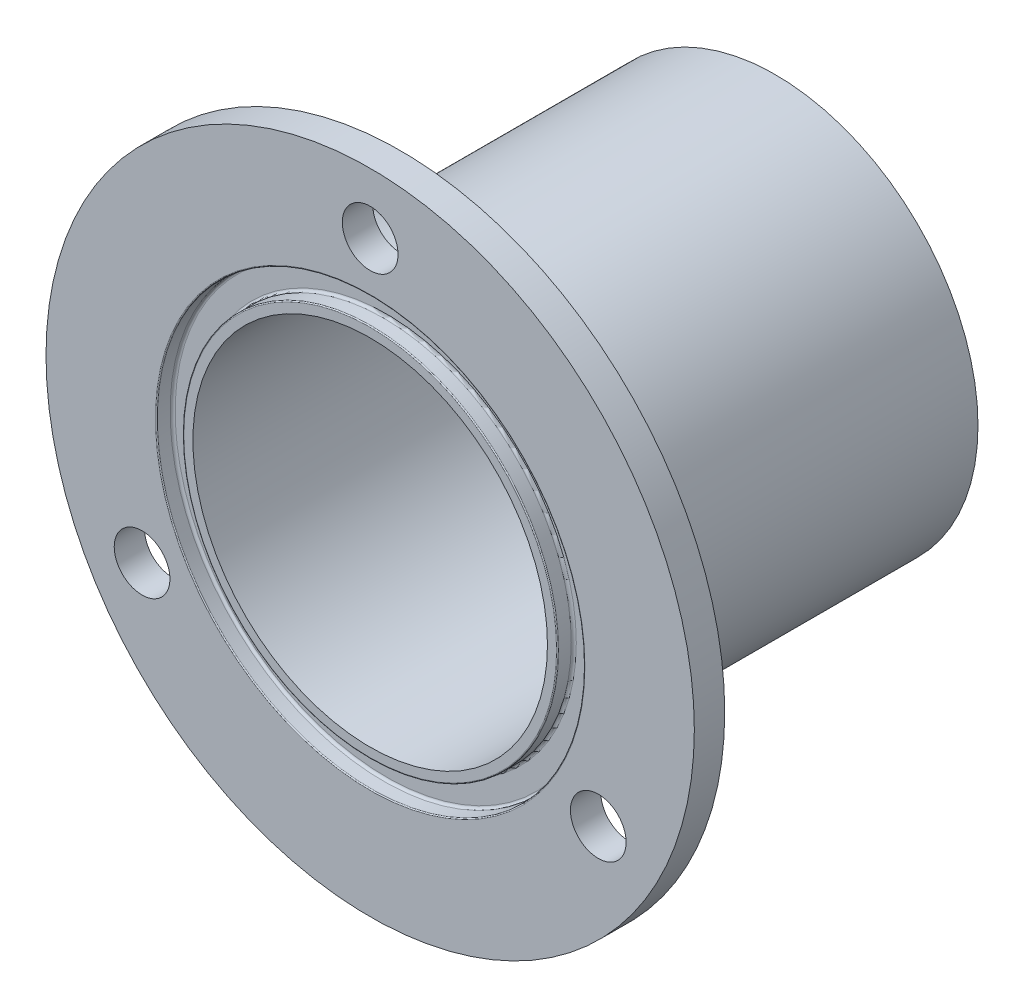
ISO-10303-21;
HEADER;
FILE_DESCRIPTION(('STEP AP214'),'2;1');
FILE_NAME('part.step','',(''),(''),'','','');
FILE_SCHEMA(('AUTOMOTIVE_DESIGN { 1 0 10303 214 1 1 1 1 }'));
ENDSEC;
DATA;
#1=APPLICATION_CONTEXT('core data for automotive mechanical design processes');
#2=APPLICATION_PROTOCOL_DEFINITION('international standard','automotive_design',2000,#1);
#3=PRODUCT_CONTEXT('',#1,'mechanical');
#4=PRODUCT('Part','Part','',(#3));
#5=PRODUCT_RELATED_PRODUCT_CATEGORY('part','',(#4));
#6=PRODUCT_DEFINITION_FORMATION('','',#4);
#7=PRODUCT_DEFINITION_CONTEXT('part definition',#1,'design');
#8=PRODUCT_DEFINITION('design','',#6,#7);
#9=PRODUCT_DEFINITION_SHAPE('','',#8);
#10=(LENGTH_UNIT() NAMED_UNIT(*) SI_UNIT(.MILLI.,.METRE.));
#11=(NAMED_UNIT(*) PLANE_ANGLE_UNIT() SI_UNIT($,.RADIAN.));
#12=(NAMED_UNIT(*) SI_UNIT($,.STERADIAN.) SOLID_ANGLE_UNIT());
#13=UNCERTAINTY_MEASURE_WITH_UNIT(LENGTH_MEASURE(1.E-05),#10,'distance_accuracy_value','');
#14=(GEOMETRIC_REPRESENTATION_CONTEXT(3) GLOBAL_UNCERTAINTY_ASSIGNED_CONTEXT((#13)) GLOBAL_UNIT_ASSIGNED_CONTEXT((#10,
#11,#12)) REPRESENTATION_CONTEXT('',''));
#15=CARTESIAN_POINT('',(0.,0.,0.));
#16=DIRECTION('',(0.,0.,1.));
#17=DIRECTION('',(1.,0.,0.));
#18=AXIS2_PLACEMENT_3D('',#15,#16,#17);
#19=CARTESIAN_POINT('',(0.,0.,20.));
#20=DIRECTION('',(0.,0.,1.));
#21=DIRECTION('',(1.,0.,0.));
#22=AXIS2_PLACEMENT_3D('',#19,#20,#21);
#23=PLANE('',#22);
#24=CARTESIAN_POINT('',(0.,0.,20.));
#25=DIRECTION('',(0.,0.,1.));
#26=DIRECTION('',(1.,0.,0.));
#27=AXIS2_PLACEMENT_3D('',#24,#25,#26);
#28=CIRCLE('',#27,18.4);
#29=CARTESIAN_POINT('',(18.4,0.,20.));
#30=VERTEX_POINT('',#29);
#31=EDGE_CURVE('E60',#30,#30,#28,.T.);
#32=ORIENTED_EDGE('',*,*,#31,.T.);
#33=EDGE_LOOP('',(#32));
#34=FACE_BOUND('',#33,.T.);
#35=CARTESIAN_POINT('',(0.,0.,20.));
#36=DIRECTION('',(0.,0.,1.));
#37=DIRECTION('',(1.,0.,0.));
#38=AXIS2_PLACEMENT_3D('',#35,#36,#37);
#39=CIRCLE('',#38,17.5);
#40=CARTESIAN_POINT('',(17.5,0.,20.));
#41=VERTEX_POINT('',#40);
#42=EDGE_CURVE('E84',#41,#41,#39,.T.);
#43=ORIENTED_EDGE('',*,*,#42,.F.);
#44=EDGE_LOOP('',(#43));
#45=FACE_BOUND('',#44,.T.);
#46=ADVANCED_FACE('F37',(#34,#45),#23,.T.);
#47=CARTESIAN_POINT('',(0.,0.,20.));
#48=DIRECTION('',(0.,0.,-1.));
#49=DIRECTION('',(-1.,0.,0.));
#50=AXIS2_PLACEMENT_3D('',#47,#48,#49);
#51=CYLINDRICAL_SURFACE('',#50,20.);
#52=CARTESIAN_POINT('',(0.,0.,16.));
#53=DIRECTION('',(0.,0.,1.));
#54=DIRECTION('',(1.,0.,0.));
#55=AXIS2_PLACEMENT_3D('',#52,#53,#54);
#56=CIRCLE('',#55,20.);
#57=CARTESIAN_POINT('',(20.,0.,16.));
#58=VERTEX_POINT('',#57);
#59=EDGE_CURVE('E10',#58,#58,#56,.F.);
#60=ORIENTED_EDGE('',*,*,#59,.T.);
#61=EDGE_LOOP('',(#60));
#62=FACE_BOUND('',#61,.T.);
#63=CARTESIAN_POINT('',(0.,0.,-20.));
#64=DIRECTION('',(0.,0.,1.));
#65=DIRECTION('',(1.,0.,0.));
#66=AXIS2_PLACEMENT_3D('',#63,#64,#65);
#67=CIRCLE('',#66,20.);
#68=CARTESIAN_POINT('',(20.,0.,-20.));
#69=VERTEX_POINT('',#68);
#70=EDGE_CURVE('E81',#69,#69,#67,.T.);
#71=ORIENTED_EDGE('',*,*,#70,.T.);
#72=EDGE_LOOP('',(#71));
#73=FACE_BOUND('',#72,.T.);
#74=ADVANCED_FACE('F143',(#62,#73),#51,.T.);
#75=CARTESIAN_POINT('',(0.,0.,20.));
#76=DIRECTION('',(0.,0.,1.));
#77=DIRECTION('',(1.,0.,0.));
#78=AXIS2_PLACEMENT_3D('',#75,#76,#77);
#79=CIRCLE('',#78,21.2);
#80=CARTESIAN_POINT('',(21.2,0.,20.));
#81=VERTEX_POINT('',#80);
#82=EDGE_CURVE('E48',#81,#81,#79,.F.);
#83=ORIENTED_EDGE('',*,*,#82,.T.);
#84=EDGE_LOOP('',(#83));
#85=FACE_BOUND('',#84,.T.);
#86=CARTESIAN_POINT('',(-22.5166604983953,-13.0000000000001,20.));
#87=DIRECTION('',(0.,0.,-1.));
#88=DIRECTION('',(0.500000000000004,-0.866025403784436,0.));
#89=AXIS2_PLACEMENT_3D('',#86,#87,#88);
#90=CIRCLE('',#89,2.75);
#91=CARTESIAN_POINT('',(-21.1416604983953,-15.3815698604073,20.));
#92=VERTEX_POINT('',#91);
#93=EDGE_CURVE('E103',#92,#92,#90,.T.);
#94=ORIENTED_EDGE('',*,*,#93,.T.);
#95=EDGE_LOOP('',(#94));
#96=FACE_BOUND('',#95,.T.);
#97=CARTESIAN_POINT('',(22.5166604983955,-12.9999999999998,20.));
#98=DIRECTION('',(0.,0.,-1.));
#99=DIRECTION('',(0.499999999999992,0.866025403784443,0.));
#100=AXIS2_PLACEMENT_3D('',#97,#98,#99);
#101=CIRCLE('',#100,2.75);
#102=CARTESIAN_POINT('',(23.8916604983955,-10.6184301395926,20.));
#103=VERTEX_POINT('',#102);
#104=EDGE_CURVE('E104',#103,#103,#101,.T.);
#105=ORIENTED_EDGE('',*,*,#104,.T.);
#106=EDGE_LOOP('',(#105));
#107=FACE_BOUND('',#106,.T.);
#108=CARTESIAN_POINT('',(0.,26.,20.));
#109=DIRECTION('',(0.,0.,-1.));
#110=DIRECTION('',(-1.,0.,0.));
#111=AXIS2_PLACEMENT_3D('',#108,#109,#110);
#112=CIRCLE('',#111,2.75);
#113=CARTESIAN_POINT('',(-2.75,26.,20.));
#114=VERTEX_POINT('',#113);
#115=EDGE_CURVE('E91',#114,#114,#112,.T.);
#116=ORIENTED_EDGE('',*,*,#115,.T.);
#117=EDGE_LOOP('',(#116));
#118=FACE_BOUND('',#117,.T.);
#119=CARTESIAN_POINT('',(0.,0.,20.));
#120=DIRECTION('',(0.,0.,1.));
#121=DIRECTION('',(1.,0.,0.));
#122=AXIS2_PLACEMENT_3D('',#119,#120,#121);
#123=CIRCLE('',#122,32.);
#124=CARTESIAN_POINT('',(32.,0.,20.));
#125=VERTEX_POINT('',#124);
#126=EDGE_CURVE('E88',#125,#125,#123,.T.);
#127=ORIENTED_EDGE('',*,*,#126,.T.);
#128=EDGE_LOOP('',(#127));
#129=FACE_BOUND('',#128,.T.);
#130=ADVANCED_FACE('F112',(#85,#96,#107,#118,#129),#23,.T.);
#131=CARTESIAN_POINT('',(0.,0.,-20.));
#132=DIRECTION('',(0.,0.,1.));
#133=DIRECTION('',(1.,0.,0.));
#134=AXIS2_PLACEMENT_3D('',#131,#132,#133);
#135=PLANE('',#134);
#136=CARTESIAN_POINT('',(0.,0.,-20.));
#137=DIRECTION('',(0.,0.,1.));
#138=DIRECTION('',(1.,0.,0.));
#139=AXIS2_PLACEMENT_3D('',#136,#137,#138);
#140=CIRCLE('',#139,18.5);
#141=CARTESIAN_POINT('',(18.5,0.,-20.));
#142=VERTEX_POINT('',#141);
#143=EDGE_CURVE('E78',#142,#142,#140,.T.);
#144=ORIENTED_EDGE('',*,*,#143,.T.);
#145=EDGE_LOOP('',(#144));
#146=FACE_BOUND('',#145,.T.);
#147=ORIENTED_EDGE('',*,*,#70,.F.);
#148=EDGE_LOOP('',(#147));
#149=FACE_BOUND('',#148,.T.);
#150=ADVANCED_FACE('F142',(#146,#149),#135,.F.);
#151=CARTESIAN_POINT('',(0.,0.,20.));
#152=DIRECTION('',(0.,0.,-1.));
#153=DIRECTION('',(-1.,0.,0.));
#154=AXIS2_PLACEMENT_3D('',#151,#152,#153);
#155=CYLINDRICAL_SURFACE('',#154,17.5);
#156=CARTESIAN_POINT('',(0.,0.,-19.));
#157=DIRECTION('',(0.,0.,1.));
#158=DIRECTION('',(1.,0.,0.));
#159=AXIS2_PLACEMENT_3D('',#156,#157,#158);
#160=CIRCLE('',#159,17.5);
#161=CARTESIAN_POINT('',(17.5,0.,-19.));
#162=VERTEX_POINT('',#161);
#163=EDGE_CURVE('E75',#162,#162,#160,.F.);
#164=ORIENTED_EDGE('',*,*,#163,.T.);
#165=EDGE_LOOP('',(#164));
#166=FACE_BOUND('',#165,.T.);
#167=ORIENTED_EDGE('',*,*,#42,.T.);
#168=EDGE_LOOP('',(#167));
#169=FACE_BOUND('',#168,.T.);
#170=ADVANCED_FACE('F150',(#166,#169),#155,.F.);
#171=CARTESIAN_POINT('',(0.,0.,-20.));
#172=DIRECTION('',(0.,0.,-1.));
#173=DIRECTION('',(-1.,0.,0.));
#174=AXIS2_PLACEMENT_3D('',#171,#172,#173);
#175=CONICAL_SURFACE('',#174,18.5,0.785398163397443);
#176=ORIENTED_EDGE('',*,*,#163,.F.);
#177=EDGE_LOOP('',(#176));
#178=FACE_BOUND('',#177,.T.);
#179=ORIENTED_EDGE('',*,*,#143,.F.);
#180=EDGE_LOOP('',(#179));
#181=FACE_BOUND('',#180,.T.);
#182=ADVANCED_FACE('F137',(#178,#181),#175,.F.);
#183=CARTESIAN_POINT('',(0.,0.,17.));
#184=DIRECTION('',(0.,0.,1.));
#185=DIRECTION('',(1.,0.,0.));
#186=AXIS2_PLACEMENT_3D('',#183,#184,#185);
#187=CYLINDRICAL_SURFACE('',#186,32.);
#188=CARTESIAN_POINT('',(0.,0.,17.));
#189=DIRECTION('',(0.,0.,1.));
#190=DIRECTION('',(1.,0.,0.));
#191=AXIS2_PLACEMENT_3D('',#188,#189,#190);
#192=CIRCLE('',#191,32.);
#193=CARTESIAN_POINT('',(32.,0.,17.));
#194=VERTEX_POINT('',#193);
#195=EDGE_CURVE('E87',#194,#194,#192,.T.);
#196=ORIENTED_EDGE('',*,*,#195,.T.);
#197=EDGE_LOOP('',(#196));
#198=FACE_BOUND('',#197,.T.);
#199=ORIENTED_EDGE('',*,*,#126,.F.);
#200=EDGE_LOOP('',(#199));
#201=FACE_BOUND('',#200,.T.);
#202=ADVANCED_FACE('F127',(#198,#201),#187,.T.);
#203=CARTESIAN_POINT('',(0.,0.,17.));
#204=DIRECTION('',(0.,0.,1.));
#205=DIRECTION('',(1.,0.,0.));
#206=AXIS2_PLACEMENT_3D('',#203,#204,#205);
#207=PLANE('',#206);
#208=CARTESIAN_POINT('',(0.,0.,17.));
#209=DIRECTION('',(0.,0.,1.));
#210=DIRECTION('',(1.,0.,0.));
#211=AXIS2_PLACEMENT_3D('',#208,#209,#210);
#212=CIRCLE('',#211,21.);
#213=CARTESIAN_POINT('',(21.,0.,17.));
#214=VERTEX_POINT('',#213);
#215=EDGE_CURVE('E44',#214,#214,#212,.T.);
#216=ORIENTED_EDGE('',*,*,#215,.T.);
#217=EDGE_LOOP('',(#216));
#218=FACE_BOUND('',#217,.T.);
#219=CARTESIAN_POINT('',(-22.5166604983953,-13.0000000000001,17.));
#220=DIRECTION('',(0.,0.,-1.));
#221=DIRECTION('',(0.500000000000004,-0.866025403784436,0.));
#222=AXIS2_PLACEMENT_3D('',#219,#220,#221);
#223=CIRCLE('',#222,2.74999999999999);
#224=CARTESIAN_POINT('',(-21.1416604983953,-15.3815698604073,17.));
#225=VERTEX_POINT('',#224);
#226=EDGE_CURVE('E99',#225,#225,#223,.T.);
#227=ORIENTED_EDGE('',*,*,#226,.F.);
#228=EDGE_LOOP('',(#227));
#229=FACE_BOUND('',#228,.T.);
#230=CARTESIAN_POINT('',(22.5166604983955,-12.9999999999998,17.));
#231=DIRECTION('',(0.,0.,-1.));
#232=DIRECTION('',(0.499999999999992,0.866025403784443,0.));
#233=AXIS2_PLACEMENT_3D('',#230,#231,#232);
#234=CIRCLE('',#233,2.74999999999999);
#235=CARTESIAN_POINT('',(23.8916604983955,-10.6184301395926,17.));
#236=VERTEX_POINT('',#235);
#237=EDGE_CURVE('E100',#236,#236,#234,.T.);
#238=ORIENTED_EDGE('',*,*,#237,.F.);
#239=EDGE_LOOP('',(#238));
#240=FACE_BOUND('',#239,.T.);
#241=CARTESIAN_POINT('',(0.,26.,17.));
#242=DIRECTION('',(0.,0.,-1.));
#243=DIRECTION('',(-1.,0.,0.));
#244=AXIS2_PLACEMENT_3D('',#241,#242,#243);
#245=CIRCLE('',#244,2.74999999999999);
#246=CARTESIAN_POINT('',(-2.74999999999999,26.,17.));
#247=VERTEX_POINT('',#246);
#248=EDGE_CURVE('E96',#247,#247,#245,.T.);
#249=ORIENTED_EDGE('',*,*,#248,.F.);
#250=EDGE_LOOP('',(#249));
#251=FACE_BOUND('',#250,.T.);
#252=ORIENTED_EDGE('',*,*,#195,.F.);
#253=EDGE_LOOP('',(#252));
#254=FACE_BOUND('',#253,.T.);
#255=ADVANCED_FACE('F123',(#218,#229,#240,#251,#254),#207,.F.);
#256=CARTESIAN_POINT('',(0.,26.,17.));
#257=DIRECTION('',(0.,0.,-1.));
#258=DIRECTION('',(-1.,0.,0.));
#259=AXIS2_PLACEMENT_3D('',#256,#257,#258);
#260=CYLINDRICAL_SURFACE('',#259,2.74999999999999);
#261=ORIENTED_EDGE('',*,*,#115,.F.);
#262=EDGE_LOOP('',(#261));
#263=FACE_BOUND('',#262,.T.);
#264=ORIENTED_EDGE('',*,*,#248,.T.);
#265=EDGE_LOOP('',(#264));
#266=FACE_BOUND('',#265,.T.);
#267=ADVANCED_FACE('F126',(#263,#266),#260,.F.);
#268=CARTESIAN_POINT('',(22.5166604983955,-12.9999999999998,17.));
#269=DIRECTION('',(0.,0.,-1.));
#270=DIRECTION('',(0.499999999999992,0.866025403784443,0.));
#271=AXIS2_PLACEMENT_3D('',#268,#269,#270);
#272=CYLINDRICAL_SURFACE('',#271,2.74999999999999);
#273=ORIENTED_EDGE('',*,*,#104,.F.);
#274=EDGE_LOOP('',(#273));
#275=FACE_BOUND('',#274,.T.);
#276=ORIENTED_EDGE('',*,*,#237,.T.);
#277=EDGE_LOOP('',(#276));
#278=FACE_BOUND('',#277,.T.);
#279=ADVANCED_FACE('F119',(#275,#278),#272,.F.);
#280=CARTESIAN_POINT('',(-22.5166604983953,-13.0000000000001,17.));
#281=DIRECTION('',(0.,0.,-1.));
#282=DIRECTION('',(0.500000000000004,-0.866025403784436,0.));
#283=AXIS2_PLACEMENT_3D('',#280,#281,#282);
#284=CYLINDRICAL_SURFACE('',#283,2.74999999999999);
#285=ORIENTED_EDGE('',*,*,#93,.F.);
#286=EDGE_LOOP('',(#285));
#287=FACE_BOUND('',#286,.T.);
#288=ORIENTED_EDGE('',*,*,#226,.T.);
#289=EDGE_LOOP('',(#288));
#290=FACE_BOUND('',#289,.T.);
#291=ADVANCED_FACE('F115',(#287,#290),#284,.F.);
#292=CARTESIAN_POINT('',(0.,0.,18.4));
#293=DIRECTION('',(0.,0.,1.));
#294=DIRECTION('',(1.,0.,0.));
#295=AXIS2_PLACEMENT_3D('',#292,#293,#294);
#296=CYLINDRICAL_SURFACE('',#295,21.1);
#297=CARTESIAN_POINT('',(0.,0.,19.9));
#298=DIRECTION('',(0.,0.,1.));
#299=DIRECTION('',(1.,0.,0.));
#300=AXIS2_PLACEMENT_3D('',#297,#298,#299);
#301=CIRCLE('',#300,21.1);
#302=CARTESIAN_POINT('',(21.1,0.,19.9));
#303=VERTEX_POINT('',#302);
#304=EDGE_CURVE('E52',#303,#303,#301,.T.);
#305=ORIENTED_EDGE('',*,*,#304,.T.);
#306=EDGE_LOOP('',(#305));
#307=FACE_BOUND('',#306,.T.);
#308=CARTESIAN_POINT('',(0.,0.,18.65));
#309=DIRECTION('',(0.,0.,1.));
#310=DIRECTION('',(1.,0.,0.));
#311=AXIS2_PLACEMENT_3D('',#308,#309,#310);
#312=CIRCLE('',#311,21.1);
#313=CARTESIAN_POINT('',(21.1,0.,18.65));
#314=VERTEX_POINT('',#313);
#315=EDGE_CURVE('E63',#314,#314,#312,.F.);
#316=ORIENTED_EDGE('',*,*,#315,.T.);
#317=EDGE_LOOP('',(#316));
#318=FACE_BOUND('',#317,.T.);
#319=ADVANCED_FACE('F118',(#307,#318),#296,.F.);
#320=CARTESIAN_POINT('',(0.,0.,18.4));
#321=DIRECTION('',(0.,0.,1.));
#322=DIRECTION('',(1.,0.,0.));
#323=AXIS2_PLACEMENT_3D('',#320,#321,#322);
#324=PLANE('',#323);
#325=CARTESIAN_POINT('',(0.,0.,18.4));
#326=DIRECTION('',(0.,0.,1.));
#327=DIRECTION('',(1.,0.,0.));
#328=AXIS2_PLACEMENT_3D('',#325,#326,#327);
#329=CIRCLE('',#328,18.75);
#330=CARTESIAN_POINT('',(18.75,0.,18.4));
#331=VERTEX_POINT('',#330);
#332=EDGE_CURVE('E66',#331,#331,#329,.F.);
#333=ORIENTED_EDGE('',*,*,#332,.T.);
#334=EDGE_LOOP('',(#333));
#335=FACE_BOUND('',#334,.T.);
#336=CARTESIAN_POINT('',(0.,0.,18.4));
#337=DIRECTION('',(0.,0.,1.));
#338=DIRECTION('',(1.,0.,0.));
#339=AXIS2_PLACEMENT_3D('',#336,#337,#338);
#340=CIRCLE('',#339,20.85);
#341=CARTESIAN_POINT('',(20.85,0.,18.4));
#342=VERTEX_POINT('',#341);
#343=EDGE_CURVE('E69',#342,#342,#340,.T.);
#344=ORIENTED_EDGE('',*,*,#343,.T.);
#345=EDGE_LOOP('',(#344));
#346=FACE_BOUND('',#345,.T.);
#347=ADVANCED_FACE('F179',(#335,#346),#324,.T.);
#348=CARTESIAN_POINT('',(0.,0.,18.4));
#349=DIRECTION('',(0.,0.,1.));
#350=DIRECTION('',(1.,0.,0.));
#351=AXIS2_PLACEMENT_3D('',#348,#349,#350);
#352=CYLINDRICAL_SURFACE('',#351,18.5);
#353=CARTESIAN_POINT('',(0.,0.,19.9));
#354=DIRECTION('',(0.,0.,1.));
#355=DIRECTION('',(1.,0.,0.));
#356=AXIS2_PLACEMENT_3D('',#353,#354,#355);
#357=CIRCLE('',#356,18.5);
#358=CARTESIAN_POINT('',(18.5,0.,19.9));
#359=VERTEX_POINT('',#358);
#360=EDGE_CURVE('E57',#359,#359,#357,.F.);
#361=ORIENTED_EDGE('',*,*,#360,.T.);
#362=EDGE_LOOP('',(#361));
#363=FACE_BOUND('',#362,.T.);
#364=CARTESIAN_POINT('',(0.,0.,18.65));
#365=DIRECTION('',(0.,0.,1.));
#366=DIRECTION('',(1.,0.,0.));
#367=AXIS2_PLACEMENT_3D('',#364,#365,#366);
#368=CIRCLE('',#367,18.5);
#369=CARTESIAN_POINT('',(18.5,0.,18.65));
#370=VERTEX_POINT('',#369);
#371=EDGE_CURVE('E72',#370,#370,#368,.T.);
#372=ORIENTED_EDGE('',*,*,#371,.T.);
#373=EDGE_LOOP('',(#372));
#374=FACE_BOUND('',#373,.T.);
#375=ADVANCED_FACE('F183',(#363,#374),#352,.T.);
#376=CARTESIAN_POINT('',(0.,0.,18.65));
#377=DIRECTION('',(0.,0.,1.));
#378=DIRECTION('',(1.,0.,0.));
#379=AXIS2_PLACEMENT_3D('',#376,#377,#378);
#380=TOROIDAL_SURFACE('',#379,18.75,0.25);
#381=ORIENTED_EDGE('',*,*,#332,.F.);
#382=EDGE_LOOP('',(#381));
#383=FACE_BOUND('',#382,.T.);
#384=ORIENTED_EDGE('',*,*,#371,.F.);
#385=EDGE_LOOP('',(#384));
#386=FACE_BOUND('',#385,.T.);
#387=ADVANCED_FACE('F186',(#383,#386),#380,.F.);
#388=CARTESIAN_POINT('',(0.,0.,18.65));
#389=DIRECTION('',(0.,0.,1.));
#390=DIRECTION('',(1.,0.,0.));
#391=AXIS2_PLACEMENT_3D('',#388,#389,#390);
#392=TOROIDAL_SURFACE('',#391,20.85,0.25);
#393=ORIENTED_EDGE('',*,*,#315,.F.);
#394=EDGE_LOOP('',(#393));
#395=FACE_BOUND('',#394,.T.);
#396=ORIENTED_EDGE('',*,*,#343,.F.);
#397=EDGE_LOOP('',(#396));
#398=FACE_BOUND('',#397,.T.);
#399=ADVANCED_FACE('F191',(#395,#398),#392,.F.);
#400=CARTESIAN_POINT('',(0.,0.,19.9));
#401=DIRECTION('',(0.,0.,1.));
#402=DIRECTION('',(1.,0.,0.));
#403=AXIS2_PLACEMENT_3D('',#400,#401,#402);
#404=TOROIDAL_SURFACE('',#403,18.4,0.1);
#405=ORIENTED_EDGE('',*,*,#360,.F.);
#406=EDGE_LOOP('',(#405));
#407=FACE_BOUND('',#406,.T.);
#408=ORIENTED_EDGE('',*,*,#31,.F.);
#409=EDGE_LOOP('',(#408));
#410=FACE_BOUND('',#409,.T.);
#411=ADVANCED_FACE('F199',(#407,#410),#404,.T.);
#412=CARTESIAN_POINT('',(0.,0.,19.9));
#413=DIRECTION('',(0.,0.,1.));
#414=DIRECTION('',(1.,0.,0.));
#415=AXIS2_PLACEMENT_3D('',#412,#413,#414);
#416=TOROIDAL_SURFACE('',#415,21.2,0.1);
#417=ORIENTED_EDGE('',*,*,#82,.F.);
#418=EDGE_LOOP('',(#417));
#419=FACE_BOUND('',#418,.T.);
#420=ORIENTED_EDGE('',*,*,#304,.F.);
#421=EDGE_LOOP('',(#420));
#422=FACE_BOUND('',#421,.T.);
#423=ADVANCED_FACE('F202',(#419,#422),#416,.T.);
#424=CARTESIAN_POINT('',(0.,0.,16.));
#425=DIRECTION('',(0.,0.,1.));
#426=DIRECTION('',(1.,0.,0.));
#427=AXIS2_PLACEMENT_3D('',#424,#425,#426);
#428=TOROIDAL_SURFACE('',#427,21.,1.);
#429=ORIENTED_EDGE('',*,*,#59,.F.);
#430=EDGE_LOOP('',(#429));
#431=FACE_BOUND('',#430,.T.);
#432=ORIENTED_EDGE('',*,*,#215,.F.);
#433=EDGE_LOOP('',(#432));
#434=FACE_BOUND('',#433,.T.);
#435=ADVANCED_FACE('F39',(#431,#434),#428,.F.);
#436=CLOSED_SHELL('',(#46,#74,#130,#150,#170,#182,#202,#255,#267,#279,#291,#319,#347,#375,#387,
#399,#411,#423,#435));
#437=MANIFOLD_SOLID_BREP('B2',#436);
#438=ADVANCED_BREP_SHAPE_REPRESENTATION('',(#18,#437),#14);
#439=SHAPE_DEFINITION_REPRESENTATION(#9,#438);
ENDSEC;
END-ISO-10303-21;
